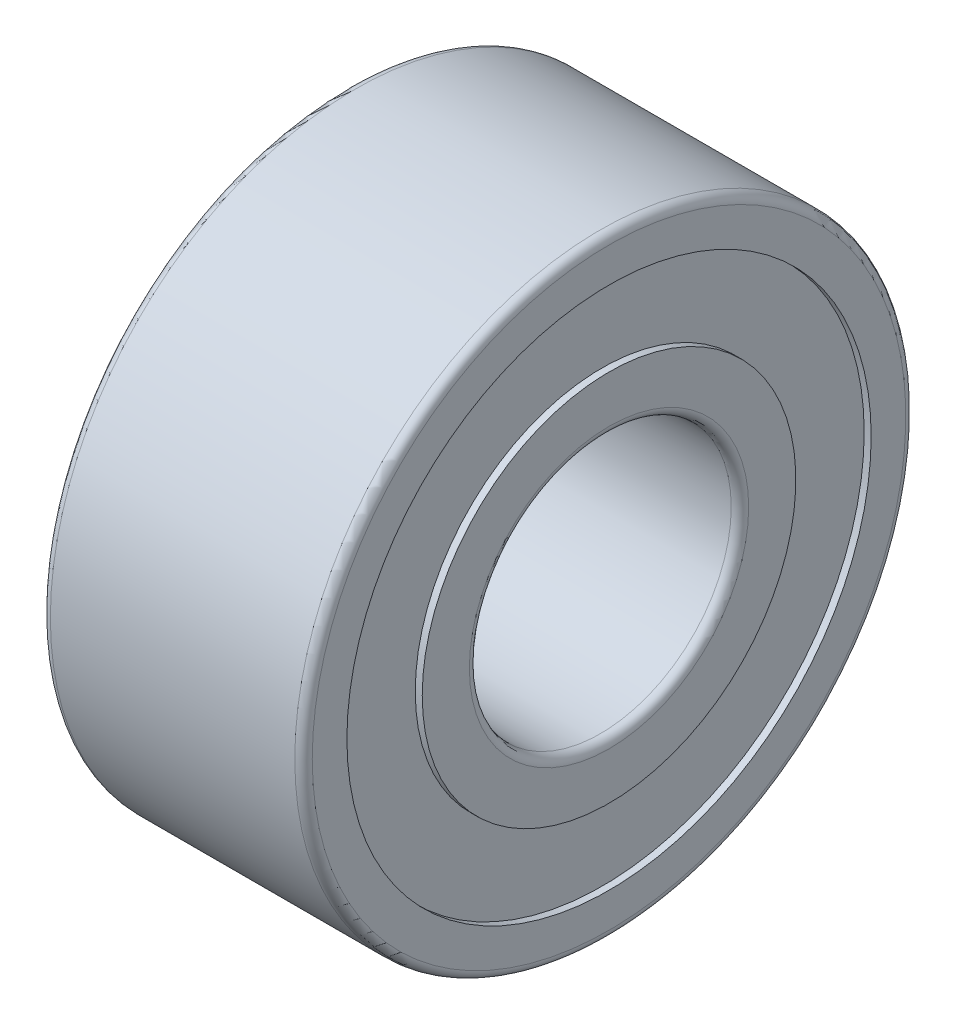
ISO-10303-21;
HEADER;
FILE_DESCRIPTION(('STEP AP214'),'2;1');
FILE_NAME('part.step','',(''),(''),'','','');
FILE_SCHEMA(('AUTOMOTIVE_DESIGN { 1 0 10303 214 1 1 1 1 }'));
ENDSEC;
DATA;
#1=APPLICATION_CONTEXT('core data for automotive mechanical design processes');
#2=APPLICATION_PROTOCOL_DEFINITION('international standard','automotive_design',2000,#1);
#3=PRODUCT_CONTEXT('',#1,'mechanical');
#4=PRODUCT('Part','Part','',(#3));
#5=PRODUCT_RELATED_PRODUCT_CATEGORY('part','',(#4));
#6=PRODUCT_DEFINITION_FORMATION('','',#4);
#7=PRODUCT_DEFINITION_CONTEXT('part definition',#1,'design');
#8=PRODUCT_DEFINITION('design','',#6,#7);
#9=PRODUCT_DEFINITION_SHAPE('','',#8);
#10=(LENGTH_UNIT() NAMED_UNIT(*) SI_UNIT(.MILLI.,.METRE.));
#11=(NAMED_UNIT(*) PLANE_ANGLE_UNIT() SI_UNIT($,.RADIAN.));
#12=(NAMED_UNIT(*) SI_UNIT($,.STERADIAN.) SOLID_ANGLE_UNIT());
#13=UNCERTAINTY_MEASURE_WITH_UNIT(LENGTH_MEASURE(1.E-05),#10,'distance_accuracy_value','');
#14=(GEOMETRIC_REPRESENTATION_CONTEXT(3) GLOBAL_UNCERTAINTY_ASSIGNED_CONTEXT((#13)) GLOBAL_UNIT_ASSIGNED_CONTEXT((#10,
#11,#12)) REPRESENTATION_CONTEXT('',''));
#15=CARTESIAN_POINT('',(0.,0.,0.));
#16=DIRECTION('',(0.,0.,1.));
#17=DIRECTION('',(1.,0.,0.));
#18=AXIS2_PLACEMENT_3D('',#15,#16,#17);
#19=CARTESIAN_POINT('',(0.,-2.14000000000002,-2.14));
#20=DIRECTION('',(-1.,0.,0.));
#21=DIRECTION('',(0.,0.,1.));
#22=AXIS2_PLACEMENT_3D('',#19,#20,#21);
#23=PLANE('',#22);
#24=CARTESIAN_POINT('',(0.,0.,0.));
#25=DIRECTION('',(-1.,0.,0.));
#26=DIRECTION('',(0.,0.,-1.));
#27=AXIS2_PLACEMENT_3D('',#24,#25,#26);
#28=CIRCLE('',#27,2.14);
#29=CARTESIAN_POINT('',(0.,0.,-2.14));
#30=VERTEX_POINT('',#29);
#31=EDGE_CURVE('E67',#30,#30,#28,.F.);
#32=ORIENTED_EDGE('',*,*,#31,.F.);
#33=EDGE_LOOP('',(#32));
#34=FACE_BOUND('',#33,.T.);
#35=CARTESIAN_POINT('',(0.,0.,0.));
#36=DIRECTION('',(1.,0.,0.));
#37=DIRECTION('',(0.,-1.42053887541853E-07,0.99999999999999));
#38=AXIS2_PLACEMENT_3D('',#35,#36,#37);
#39=CIRCLE('',#38,1.59999999999992);
#40=CARTESIAN_POINT('',(0.,-2.27286220066953E-07,1.5999999999999));
#41=VERTEX_POINT('',#40);
#42=EDGE_CURVE('E64',#41,#41,#39,.T.);
#43=ORIENTED_EDGE('',*,*,#42,.T.);
#44=EDGE_LOOP('',(#43));
#45=FACE_BOUND('',#44,.T.);
#46=ADVANCED_FACE('F14',(#34,#45),#23,.T.);
#47=CARTESIAN_POINT('',(3.,-2.14000000000002,2.14000016413046));
#48=DIRECTION('',(1.,0.,0.));
#49=DIRECTION('',(0.,0.,-1.));
#50=AXIS2_PLACEMENT_3D('',#47,#48,#49);
#51=PLANE('',#50);
#52=CARTESIAN_POINT('',(3.,0.,0.));
#53=DIRECTION('',(1.,0.,0.));
#54=DIRECTION('',(0.,1.41914890016003E-07,0.99999999999999));
#55=AXIS2_PLACEMENT_3D('',#52,#53,#54);
#56=CIRCLE('',#55,2.14);
#57=CARTESIAN_POINT('',(3.,3.03697864634246E-07,2.13999999999998));
#58=VERTEX_POINT('',#57);
#59=EDGE_CURVE('E61',#58,#58,#56,.T.);
#60=ORIENTED_EDGE('',*,*,#59,.T.);
#61=EDGE_LOOP('',(#60));
#62=FACE_BOUND('',#61,.T.);
#63=CARTESIAN_POINT('',(3.,0.,0.));
#64=DIRECTION('',(-1.,0.,0.));
#65=DIRECTION('',(0.,0.,-1.));
#66=AXIS2_PLACEMENT_3D('',#63,#64,#65);
#67=CIRCLE('',#66,1.60000001094992);
#68=CARTESIAN_POINT('',(3.,0.,-1.60000001094992));
#69=VERTEX_POINT('',#68);
#70=EDGE_CURVE('E58',#69,#69,#67,.F.);
#71=ORIENTED_EDGE('',*,*,#70,.F.);
#72=EDGE_LOOP('',(#71));
#73=FACE_BOUND('',#72,.T.);
#74=ADVANCED_FACE('F75',(#62,#73),#51,.T.);
#75=CARTESIAN_POINT('',(2.92,-3.003,3.003));
#76=DIRECTION('',(1.,0.,0.));
#77=DIRECTION('',(0.,0.,-1.));
#78=AXIS2_PLACEMENT_3D('',#75,#76,#77);
#79=PLANE('',#78);
#80=CARTESIAN_POINT('',(2.92,0.,0.));
#81=DIRECTION('',(1.,0.,0.));
#82=DIRECTION('',(0.,0.,1.));
#83=AXIS2_PLACEMENT_3D('',#80,#81,#82);
#84=CIRCLE('',#83,3.003);
#85=CARTESIAN_POINT('',(2.92,0.,3.003));
#86=VERTEX_POINT('',#85);
#87=EDGE_CURVE('E55',#86,#86,#84,.T.);
#88=ORIENTED_EDGE('',*,*,#87,.T.);
#89=EDGE_LOOP('',(#88));
#90=FACE_BOUND('',#89,.T.);
#91=CARTESIAN_POINT('',(2.92,0.,0.));
#92=DIRECTION('',(-1.,0.,0.));
#93=DIRECTION('',(0.,0.,-1.));
#94=AXIS2_PLACEMENT_3D('',#91,#92,#93);
#95=CIRCLE('',#94,2.14);
#96=CARTESIAN_POINT('',(2.92,0.,-2.14));
#97=VERTEX_POINT('',#96);
#98=EDGE_CURVE('E52',#97,#97,#95,.F.);
#99=ORIENTED_EDGE('',*,*,#98,.F.);
#100=EDGE_LOOP('',(#99));
#101=FACE_BOUND('',#100,.T.);
#102=ADVANCED_FACE('F134',(#90,#101),#79,.T.);
#103=CARTESIAN_POINT('',(3.,-3.4,3.4));
#104=DIRECTION('',(1.,0.,0.));
#105=DIRECTION('',(0.,0.,-1.));
#106=AXIS2_PLACEMENT_3D('',#103,#104,#105);
#107=PLANE('',#106);
#108=CARTESIAN_POINT('',(3.,0.,0.));
#109=DIRECTION('',(1.,0.,0.));
#110=DIRECTION('',(0.,0.,1.));
#111=AXIS2_PLACEMENT_3D('',#108,#109,#110);
#112=CIRCLE('',#111,3.40000001788155);
#113=CARTESIAN_POINT('',(3.,0.,3.40000001788155));
#114=VERTEX_POINT('',#113);
#115=EDGE_CURVE('E49',#114,#114,#112,.T.);
#116=ORIENTED_EDGE('',*,*,#115,.T.);
#117=EDGE_LOOP('',(#116));
#118=FACE_BOUND('',#117,.T.);
#119=CARTESIAN_POINT('',(3.,0.,0.));
#120=DIRECTION('',(-1.,0.,0.));
#121=DIRECTION('',(0.,0.,-1.));
#122=AXIS2_PLACEMENT_3D('',#119,#120,#121);
#123=CIRCLE('',#122,3.003);
#124=CARTESIAN_POINT('',(3.,0.,-3.003));
#125=VERTEX_POINT('',#124);
#126=EDGE_CURVE('E46',#125,#125,#123,.F.);
#127=ORIENTED_EDGE('',*,*,#126,.F.);
#128=EDGE_LOOP('',(#127));
#129=FACE_BOUND('',#128,.T.);
#130=ADVANCED_FACE('F129',(#118,#129),#107,.T.);
#131=CARTESIAN_POINT('',(0.,-3.4,-3.4));
#132=DIRECTION('',(-1.,0.,0.));
#133=DIRECTION('',(0.,0.,1.));
#134=AXIS2_PLACEMENT_3D('',#131,#132,#133);
#135=PLANE('',#134);
#136=CARTESIAN_POINT('',(0.,0.,0.));
#137=DIRECTION('',(-1.,0.,0.));
#138=DIRECTION('',(0.,0.,-1.));
#139=AXIS2_PLACEMENT_3D('',#136,#137,#138);
#140=CIRCLE('',#139,3.40000000537277);
#141=CARTESIAN_POINT('',(0.,0.,-3.40000000537277));
#142=VERTEX_POINT('',#141);
#143=EDGE_CURVE('E43',#142,#142,#140,.F.);
#144=ORIENTED_EDGE('',*,*,#143,.F.);
#145=EDGE_LOOP('',(#144));
#146=FACE_BOUND('',#145,.T.);
#147=CARTESIAN_POINT('',(0.,0.,0.));
#148=DIRECTION('',(1.,0.,0.));
#149=DIRECTION('',(0.,0.,1.));
#150=AXIS2_PLACEMENT_3D('',#147,#148,#149);
#151=CIRCLE('',#150,3.003);
#152=CARTESIAN_POINT('',(0.,0.,3.003));
#153=VERTEX_POINT('',#152);
#154=EDGE_CURVE('E40',#153,#153,#151,.T.);
#155=ORIENTED_EDGE('',*,*,#154,.T.);
#156=EDGE_LOOP('',(#155));
#157=FACE_BOUND('',#156,.T.);
#158=ADVANCED_FACE('F93',(#146,#157),#135,.T.);
#159=CARTESIAN_POINT('',(0.08,-3.00300000000002,-3.00300000000001));
#160=DIRECTION('',(-1.,0.,0.));
#161=DIRECTION('',(0.,0.,1.));
#162=AXIS2_PLACEMENT_3D('',#159,#160,#161);
#163=PLANE('',#162);
#164=CARTESIAN_POINT('',(0.08,0.,0.));
#165=DIRECTION('',(-1.,0.,0.));
#166=DIRECTION('',(0.,0.,-1.));
#167=AXIS2_PLACEMENT_3D('',#164,#165,#166);
#168=CIRCLE('',#167,3.003);
#169=CARTESIAN_POINT('',(0.08,0.,-3.003));
#170=VERTEX_POINT('',#169);
#171=EDGE_CURVE('E37',#170,#170,#168,.F.);
#172=ORIENTED_EDGE('',*,*,#171,.F.);
#173=EDGE_LOOP('',(#172));
#174=FACE_BOUND('',#173,.T.);
#175=CARTESIAN_POINT('',(0.08,0.,0.));
#176=DIRECTION('',(1.,0.,0.));
#177=DIRECTION('',(0.,0.,1.));
#178=AXIS2_PLACEMENT_3D('',#175,#176,#177);
#179=CIRCLE('',#178,2.14);
#180=CARTESIAN_POINT('',(0.08,0.,2.14));
#181=VERTEX_POINT('',#180);
#182=EDGE_CURVE('E34',#181,#181,#179,.T.);
#183=ORIENTED_EDGE('',*,*,#182,.T.);
#184=EDGE_LOOP('',(#183));
#185=FACE_BOUND('',#184,.T.);
#186=ADVANCED_FACE('F82',(#174,#185),#163,.T.);
#187=CARTESIAN_POINT('',(0.099999999999922,0.,0.));
#188=DIRECTION('',(1.,0.,0.));
#189=DIRECTION('',(0.,0.,1.));
#190=AXIS2_PLACEMENT_3D('',#187,#188,#189);
#191=TOROIDAL_SURFACE('',#190,1.59999999999992,0.099999999999922);
#192=CARTESIAN_POINT('',(0.1,0.,0.));
#193=DIRECTION('',(1.,0.,0.));
#194=DIRECTION('',(0.,0.,1.));
#195=AXIS2_PLACEMENT_3D('',#192,#193,#194);
#196=CIRCLE('',#195,1.5);
#197=CARTESIAN_POINT('',(0.1,0.,1.5));
#198=VERTEX_POINT('',#197);
#199=EDGE_CURVE('E29',#198,#198,#196,.T.);
#200=ORIENTED_EDGE('',*,*,#199,.T.);
#201=EDGE_LOOP('',(#200));
#202=FACE_BOUND('',#201,.T.);
#203=ORIENTED_EDGE('',*,*,#42,.F.);
#204=EDGE_LOOP('',(#203));
#205=FACE_BOUND('',#204,.T.);
#206=ADVANCED_FACE('F79',(#202,#205),#191,.T.);
#207=CARTESIAN_POINT('',(2.9,0.,0.));
#208=DIRECTION('',(1.,0.,0.));
#209=DIRECTION('',(0.,0.,1.));
#210=AXIS2_PLACEMENT_3D('',#207,#208,#209);
#211=CYLINDRICAL_SURFACE('',#210,1.5);
#212=CARTESIAN_POINT('',(2.9,0.,0.));
#213=DIRECTION('',(1.,0.,0.));
#214=DIRECTION('',(0.,0.,1.));
#215=AXIS2_PLACEMENT_3D('',#212,#213,#214);
#216=CIRCLE('',#215,1.5);
#217=CARTESIAN_POINT('',(2.9,0.,1.5));
#218=VERTEX_POINT('',#217);
#219=EDGE_CURVE('E25',#218,#218,#216,.T.);
#220=ORIENTED_EDGE('',*,*,#219,.T.);
#221=EDGE_LOOP('',(#220));
#222=FACE_BOUND('',#221,.T.);
#223=ORIENTED_EDGE('',*,*,#199,.F.);
#224=EDGE_LOOP('',(#223));
#225=FACE_BOUND('',#224,.T.);
#226=ADVANCED_FACE('F81',(#222,#225),#211,.F.);
#227=CARTESIAN_POINT('',(2.90000000000015,0.,0.));
#228=DIRECTION('',(1.,0.,0.));
#229=DIRECTION('',(0.,0.,1.));
#230=AXIS2_PLACEMENT_3D('',#227,#228,#229);
#231=TOROIDAL_SURFACE('',#230,1.59999999999985,0.0999999999998457);
#232=ORIENTED_EDGE('',*,*,#70,.T.);
#233=EDGE_LOOP('',(#232));
#234=FACE_BOUND('',#233,.T.);
#235=ORIENTED_EDGE('',*,*,#219,.F.);
#236=EDGE_LOOP('',(#235));
#237=FACE_BOUND('',#236,.T.);
#238=ADVANCED_FACE('F90',(#234,#237),#231,.T.);
#239=CARTESIAN_POINT('',(2.9,0.,0.));
#240=DIRECTION('',(1.,0.,0.));
#241=DIRECTION('',(0.,1.42053888774536E-07,0.99999999999999));
#242=AXIS2_PLACEMENT_3D('',#239,#240,#241);
#243=CYLINDRICAL_SURFACE('',#242,2.14);
#244=ORIENTED_EDGE('',*,*,#98,.T.);
#245=EDGE_LOOP('',(#244));
#246=FACE_BOUND('',#245,.T.);
#247=ORIENTED_EDGE('',*,*,#59,.F.);
#248=EDGE_LOOP('',(#247));
#249=FACE_BOUND('',#248,.T.);
#250=ADVANCED_FACE('F100',(#246,#249),#243,.T.);
#251=CARTESIAN_POINT('',(2.9,0.,0.));
#252=DIRECTION('',(1.,0.,0.));
#253=DIRECTION('',(0.,1.42115231705271E-07,0.99999999999999));
#254=AXIS2_PLACEMENT_3D('',#251,#252,#253);
#255=CYLINDRICAL_SURFACE('',#254,3.003);
#256=ORIENTED_EDGE('',*,*,#126,.T.);
#257=EDGE_LOOP('',(#256));
#258=FACE_BOUND('',#257,.T.);
#259=ORIENTED_EDGE('',*,*,#87,.F.);
#260=EDGE_LOOP('',(#259));
#261=FACE_BOUND('',#260,.T.);
#262=ADVANCED_FACE('F104',(#258,#261),#255,.F.);
#263=CARTESIAN_POINT('',(2.90000000000015,0.,0.));
#264=DIRECTION('',(1.,0.,0.));
#265=DIRECTION('',(0.,0.,1.));
#266=AXIS2_PLACEMENT_3D('',#263,#264,#265);
#267=TOROIDAL_SURFACE('',#266,3.40000000000015,0.0999999999998467);
#268=CARTESIAN_POINT('',(2.90000000000015,0.,0.));
#269=DIRECTION('',(1.,0.,0.));
#270=DIRECTION('',(0.,0.,1.));
#271=AXIS2_PLACEMENT_3D('',#268,#269,#270);
#272=CIRCLE('',#271,3.5);
#273=CARTESIAN_POINT('',(2.90000000000015,0.,3.5));
#274=VERTEX_POINT('',#273);
#275=EDGE_CURVE('E21',#274,#274,#272,.T.);
#276=ORIENTED_EDGE('',*,*,#275,.T.);
#277=EDGE_LOOP('',(#276));
#278=FACE_BOUND('',#277,.T.);
#279=ORIENTED_EDGE('',*,*,#115,.F.);
#280=EDGE_LOOP('',(#279));
#281=FACE_BOUND('',#280,.T.);
#282=ADVANCED_FACE('F108',(#278,#281),#267,.T.);
#283=CARTESIAN_POINT('',(2.9,0.,0.));
#284=DIRECTION('',(1.,0.,0.));
#285=DIRECTION('',(0.,0.,1.));
#286=AXIS2_PLACEMENT_3D('',#283,#284,#285);
#287=CYLINDRICAL_SURFACE('',#286,3.5);
#288=CARTESIAN_POINT('',(0.1,0.,0.));
#289=DIRECTION('',(1.,0.,0.));
#290=DIRECTION('',(0.,0.,1.));
#291=AXIS2_PLACEMENT_3D('',#288,#289,#290);
#292=CIRCLE('',#291,3.5);
#293=CARTESIAN_POINT('',(0.1,0.,3.5));
#294=VERTEX_POINT('',#293);
#295=EDGE_CURVE('E9',#294,#294,#292,.T.);
#296=ORIENTED_EDGE('',*,*,#295,.T.);
#297=EDGE_LOOP('',(#296));
#298=FACE_BOUND('',#297,.T.);
#299=ORIENTED_EDGE('',*,*,#275,.F.);
#300=EDGE_LOOP('',(#299));
#301=FACE_BOUND('',#300,.T.);
#302=ADVANCED_FACE('F112',(#298,#301),#287,.T.);
#303=CARTESIAN_POINT('',(0.0999999999999229,0.,0.));
#304=DIRECTION('',(1.,0.,0.));
#305=DIRECTION('',(0.,0.,1.));
#306=AXIS2_PLACEMENT_3D('',#303,#304,#305);
#307=TOROIDAL_SURFACE('',#306,3.40000000000007,0.0999999999999231);
#308=ORIENTED_EDGE('',*,*,#143,.T.);
#309=EDGE_LOOP('',(#308));
#310=FACE_BOUND('',#309,.T.);
#311=ORIENTED_EDGE('',*,*,#295,.F.);
#312=EDGE_LOOP('',(#311));
#313=FACE_BOUND('',#312,.T.);
#314=ADVANCED_FACE('F115',(#310,#313),#307,.T.);
#315=CARTESIAN_POINT('',(2.9,0.,0.));
#316=DIRECTION('',(1.,0.,0.));
#317=DIRECTION('',(0.,1.42331235364674E-07,0.99999999999999));
#318=AXIS2_PLACEMENT_3D('',#315,#316,#317);
#319=CYLINDRICAL_SURFACE('',#318,3.003);
#320=ORIENTED_EDGE('',*,*,#171,.T.);
#321=EDGE_LOOP('',(#320));
#322=FACE_BOUND('',#321,.T.);
#323=ORIENTED_EDGE('',*,*,#154,.F.);
#324=EDGE_LOOP('',(#323));
#325=FACE_BOUND('',#324,.T.);
#326=ADVANCED_FACE('F117',(#322,#325),#319,.F.);
#327=CARTESIAN_POINT('',(2.9,0.,0.));
#328=DIRECTION('',(1.,0.,0.));
#329=DIRECTION('',(0.,1.42331213604303E-07,0.99999999999999));
#330=AXIS2_PLACEMENT_3D('',#327,#328,#329);
#331=CYLINDRICAL_SURFACE('',#330,2.14);
#332=ORIENTED_EDGE('',*,*,#31,.T.);
#333=EDGE_LOOP('',(#332));
#334=FACE_BOUND('',#333,.T.);
#335=ORIENTED_EDGE('',*,*,#182,.F.);
#336=EDGE_LOOP('',(#335));
#337=FACE_BOUND('',#336,.T.);
#338=ADVANCED_FACE('F16',(#334,#337),#331,.T.);
#339=CLOSED_SHELL('',(#46,#74,#102,#130,#158,#186,#206,#226,#238,#250,#262,#282,#302,#314,#326,#338));
#340=MANIFOLD_SOLID_BREP('B1',#339);
#341=ADVANCED_BREP_SHAPE_REPRESENTATION('',(#18,#340),#14);
#342=SHAPE_DEFINITION_REPRESENTATION(#9,#341);
ENDSEC;
END-ISO-10303-21;
